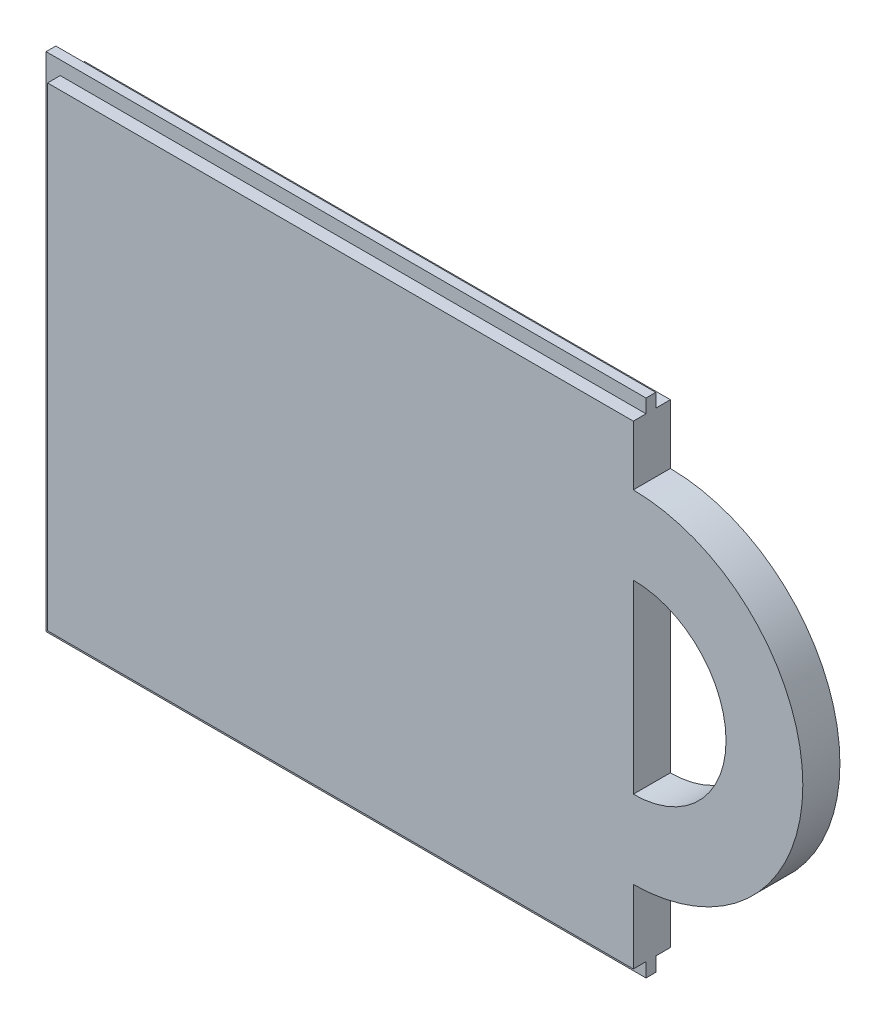
ISO-10303-21;
HEADER;
FILE_DESCRIPTION(('STEP AP214'),'2;1');
FILE_NAME('part.step','',(''),(''),'','','');
FILE_SCHEMA(('AUTOMOTIVE_DESIGN { 1 0 10303 214 1 1 1 1 }'));
ENDSEC;
DATA;
#1=APPLICATION_CONTEXT('core data for automotive mechanical design processes');
#2=APPLICATION_PROTOCOL_DEFINITION('international standard','automotive_design',2000,#1);
#3=PRODUCT_CONTEXT('',#1,'mechanical');
#4=PRODUCT('Part','Part','',(#3));
#5=PRODUCT_RELATED_PRODUCT_CATEGORY('part','',(#4));
#6=PRODUCT_DEFINITION_FORMATION('','',#4);
#7=PRODUCT_DEFINITION_CONTEXT('part definition',#1,'design');
#8=PRODUCT_DEFINITION('design','',#6,#7);
#9=PRODUCT_DEFINITION_SHAPE('','',#8);
#10=(LENGTH_UNIT() NAMED_UNIT(*) SI_UNIT(.MILLI.,.METRE.));
#11=(NAMED_UNIT(*) PLANE_ANGLE_UNIT() SI_UNIT($,.RADIAN.));
#12=(NAMED_UNIT(*) SI_UNIT($,.STERADIAN.) SOLID_ANGLE_UNIT());
#13=UNCERTAINTY_MEASURE_WITH_UNIT(LENGTH_MEASURE(1.E-05),#10,'distance_accuracy_value','');
#14=(GEOMETRIC_REPRESENTATION_CONTEXT(3) GLOBAL_UNCERTAINTY_ASSIGNED_CONTEXT((#13)) GLOBAL_UNIT_ASSIGNED_CONTEXT((#10,
#11,#12)) REPRESENTATION_CONTEXT('',''));
#15=CARTESIAN_POINT('',(0.,0.,0.));
#16=DIRECTION('',(0.,0.,1.));
#17=DIRECTION('',(1.,0.,0.));
#18=AXIS2_PLACEMENT_3D('',#15,#16,#17);
#19=CARTESIAN_POINT('',(-30.8641975308642,23.6,3.8));
#20=DIRECTION('',(1.,0.,0.));
#21=DIRECTION('',(0.,1.,0.));
#22=AXIS2_PLACEMENT_3D('',#19,#20,#21);
#23=PLANE('',#22);
#24=DIRECTION('',(0.,1.,0.));
#25=VECTOR('',#24,1.);
#26=CARTESIAN_POINT('',(-30.8641975308642,23.6,2.5));
#27=LINE('',#26,#25);
#28=CARTESIAN_POINT('',(-30.8641975308642,-25.,2.5));
#29=VERTEX_POINT('',#28);
#30=CARTESIAN_POINT('',(-30.8641975308642,23.6,2.5));
#31=VERTEX_POINT('',#30);
#32=EDGE_CURVE('E56',#29,#31,#27,.T.);
#33=ORIENTED_EDGE('',*,*,#32,.F.);
#34=DIRECTION('',(0.,0.,-1.));
#35=VECTOR('',#34,1.);
#36=CARTESIAN_POINT('',(-30.8641975308642,-25.,3.8));
#37=LINE('',#36,#35);
#38=CARTESIAN_POINT('',(-30.8641975308642,-25.,3.8));
#39=VERTEX_POINT('',#38);
#40=EDGE_CURVE('E11',#39,#29,#37,.T.);
#41=ORIENTED_EDGE('',*,*,#40,.F.);
#42=DIRECTION('',(0.,-1.,0.));
#43=VECTOR('',#42,1.);
#44=CARTESIAN_POINT('',(-30.8641975308642,23.6,3.8));
#45=LINE('',#44,#43);
#46=CARTESIAN_POINT('',(-30.8641975308642,23.6,3.8));
#47=VERTEX_POINT('',#46);
#48=EDGE_CURVE('E231',#47,#39,#45,.T.);
#49=ORIENTED_EDGE('',*,*,#48,.F.);
#50=DIRECTION('',(0.,0.,-1.));
#51=VECTOR('',#50,1.);
#52=CARTESIAN_POINT('',(-30.8641975308642,23.6,3.8));
#53=LINE('',#52,#51);
#54=EDGE_CURVE('E255',#47,#31,#53,.T.);
#55=ORIENTED_EDGE('',*,*,#54,.T.);
#56=EDGE_LOOP('',(#33,#41,#49,#55));
#57=FACE_BOUND('',#56,.T.);
#58=ADVANCED_FACE('F33',(#57),#23,.F.);
#59=CARTESIAN_POINT('',(29.1358024691358,-25.,3.8));
#60=DIRECTION('',(0.,1.,0.));
#61=DIRECTION('',(-1.,0.,0.));
#62=AXIS2_PLACEMENT_3D('',#59,#60,#61);
#63=PLANE('',#62);
#64=DIRECTION('',(-1.,0.,0.));
#65=VECTOR('',#64,1.);
#66=CARTESIAN_POINT('',(29.1358024691358,-25.,2.5));
#67=LINE('',#66,#65);
#68=CARTESIAN_POINT('',(29.1358024691358,-25.,2.5));
#69=VERTEX_POINT('',#68);
#70=EDGE_CURVE('E196',#69,#29,#67,.T.);
#71=ORIENTED_EDGE('',*,*,#70,.F.);
#72=DIRECTION('',(0.,0.,-1.));
#73=VECTOR('',#72,1.);
#74=CARTESIAN_POINT('',(29.1358024691358,-25.,3.8));
#75=LINE('',#74,#73);
#76=CARTESIAN_POINT('',(29.1358024691358,-25.,3.8));
#77=VERTEX_POINT('',#76);
#78=EDGE_CURVE('E260',#77,#69,#75,.T.);
#79=ORIENTED_EDGE('',*,*,#78,.F.);
#80=DIRECTION('',(1.,0.,0.));
#81=VECTOR('',#80,1.);
#82=CARTESIAN_POINT('',(29.1358024691358,-25.,3.8));
#83=LINE('',#82,#81);
#84=EDGE_CURVE('E234',#39,#77,#83,.T.);
#85=ORIENTED_EDGE('',*,*,#84,.F.);
#86=ORIENTED_EDGE('',*,*,#40,.T.);
#87=EDGE_LOOP('',(#71,#79,#85,#86));
#88=FACE_BOUND('',#87,.T.);
#89=ADVANCED_FACE('F285',(#88),#63,.F.);
#90=CARTESIAN_POINT('',(29.1358024691358,23.6,3.8));
#91=DIRECTION('',(0.,-1.,0.));
#92=DIRECTION('',(1.,0.,0.));
#93=AXIS2_PLACEMENT_3D('',#90,#91,#92);
#94=PLANE('',#93);
#95=DIRECTION('',(1.,0.,0.));
#96=VECTOR('',#95,1.);
#97=CARTESIAN_POINT('',(29.1358024691358,23.6,2.5));
#98=LINE('',#97,#96);
#99=CARTESIAN_POINT('',(29.1358024691358,23.6,2.5));
#100=VERTEX_POINT('',#99);
#101=EDGE_CURVE('E188',#31,#100,#98,.T.);
#102=ORIENTED_EDGE('',*,*,#101,.F.);
#103=ORIENTED_EDGE('',*,*,#54,.F.);
#104=DIRECTION('',(-1.,0.,0.));
#105=VECTOR('',#104,1.);
#106=CARTESIAN_POINT('',(29.1358024691358,23.6,3.8));
#107=LINE('',#106,#105);
#108=CARTESIAN_POINT('',(29.1358024691358,23.6,3.8));
#109=VERTEX_POINT('',#108);
#110=EDGE_CURVE('E241',#109,#47,#107,.T.);
#111=ORIENTED_EDGE('',*,*,#110,.F.);
#112=DIRECTION('',(0.,0.,-1.));
#113=VECTOR('',#112,1.);
#114=CARTESIAN_POINT('',(29.1358024691358,23.6,3.8));
#115=LINE('',#114,#113);
#116=EDGE_CURVE('E258',#109,#100,#115,.T.);
#117=ORIENTED_EDGE('',*,*,#116,.T.);
#118=EDGE_LOOP('',(#102,#103,#111,#117));
#119=FACE_BOUND('',#118,.T.);
#120=ADVANCED_FACE('F308',(#119),#94,.F.);
#121=CARTESIAN_POINT('',(29.1358024691358,23.6,3.8));
#122=DIRECTION('',(-1.,0.,0.));
#123=DIRECTION('',(0.,-1.,0.));
#124=AXIS2_PLACEMENT_3D('',#121,#122,#123);
#125=PLANE('',#124);
#126=DIRECTION('',(0.,0.,1.));
#127=VECTOR('',#126,1.);
#128=CARTESIAN_POINT('',(29.1358024691358,-17.4994861634678,-49.4974746830584));
#129=LINE('',#128,#127);
#130=CARTESIAN_POINT('',(29.1358024691358,-17.4994861634678,0.));
#131=VERTEX_POINT('',#130);
#132=CARTESIAN_POINT('',(29.1358024691358,-17.4994861634678,3.8));
#133=VERTEX_POINT('',#132);
#134=EDGE_CURVE('E228',#131,#133,#129,.T.);
#135=ORIENTED_EDGE('',*,*,#134,.T.);
#136=DIRECTION('',(0.,1.,0.));
#137=VECTOR('',#136,1.);
#138=CARTESIAN_POINT('',(29.1358024691358,23.6,3.8));
#139=LINE('',#138,#137);
#140=EDGE_CURVE('E238',#77,#133,#139,.T.);
#141=ORIENTED_EDGE('',*,*,#140,.F.);
#142=ORIENTED_EDGE('',*,*,#78,.T.);
#143=DIRECTION('',(0.,1.,0.));
#144=VECTOR('',#143,1.);
#145=CARTESIAN_POINT('',(29.1358024691358,25.,2.5));
#146=LINE('',#145,#144);
#147=CARTESIAN_POINT('',(29.1358024691358,-26.45,2.5));
#148=VERTEX_POINT('',#147);
#149=EDGE_CURVE('E176',#148,#69,#146,.T.);
#150=ORIENTED_EDGE('',*,*,#149,.F.);
#151=DIRECTION('',(0.,0.,1.));
#152=VECTOR('',#151,1.);
#153=CARTESIAN_POINT('',(29.1358024691358,-26.45,1.5));
#154=LINE('',#153,#152);
#155=CARTESIAN_POINT('',(29.1358024691358,-26.45,1.5));
#156=VERTEX_POINT('',#155);
#157=EDGE_CURVE('E157',#156,#148,#154,.T.);
#158=ORIENTED_EDGE('',*,*,#157,.F.);
#159=DIRECTION('',(0.,1.,0.));
#160=VECTOR('',#159,1.);
#161=CARTESIAN_POINT('',(29.1358024691358,25.,1.5));
#162=LINE('',#161,#160);
#163=CARTESIAN_POINT('',(29.1358024691358,-25.,1.5));
#164=VERTEX_POINT('',#163);
#165=EDGE_CURVE('E168',#156,#164,#162,.T.);
#166=ORIENTED_EDGE('',*,*,#165,.T.);
#167=CARTESIAN_POINT('',(29.1358024691358,-25.,0.));
#168=VERTEX_POINT('',#167);
#169=EDGE_CURVE('E259',#164,#168,#75,.T.);
#170=ORIENTED_EDGE('',*,*,#169,.T.);
#171=DIRECTION('',(0.,1.,0.));
#172=VECTOR('',#171,1.);
#173=CARTESIAN_POINT('',(29.1358024691358,23.6,0.));
#174=LINE('',#173,#172);
#175=EDGE_CURVE('E250',#168,#131,#174,.T.);
#176=ORIENTED_EDGE('',*,*,#175,.T.);
#177=EDGE_LOOP('',(#135,#141,#142,#150,#158,#166,#170,#176));
#178=FACE_BOUND('',#177,.T.);
#179=ADVANCED_FACE('F266',(#178),#125,.F.);
#180=CARTESIAN_POINT('',(-30.8641975308642,-25.,1.5));
#181=VERTEX_POINT('',#180);
#182=CARTESIAN_POINT('',(-30.8641975308642,-25.,0.));
#183=VERTEX_POINT('',#182);
#184=EDGE_CURVE('E41',#181,#183,#37,.T.);
#185=ORIENTED_EDGE('',*,*,#184,.F.);
#186=DIRECTION('',(0.,1.,0.));
#187=VECTOR('',#186,1.);
#188=CARTESIAN_POINT('',(-30.8641975308642,23.6,1.5));
#189=LINE('',#188,#187);
#190=CARTESIAN_POINT('',(-30.8641975308642,23.6,1.5));
#191=VERTEX_POINT('',#190);
#192=EDGE_CURVE('E201',#181,#191,#189,.T.);
#193=ORIENTED_EDGE('',*,*,#192,.T.);
#194=CARTESIAN_POINT('',(-30.8641975308642,23.6,0.));
#195=VERTEX_POINT('',#194);
#196=EDGE_CURVE('E243',#191,#195,#53,.T.);
#197=ORIENTED_EDGE('',*,*,#196,.T.);
#198=DIRECTION('',(0.,-1.,0.));
#199=VECTOR('',#198,1.);
#200=CARTESIAN_POINT('',(-30.8641975308642,23.6,0.));
#201=LINE('',#200,#199);
#202=EDGE_CURVE('E230',#195,#183,#201,.T.);
#203=ORIENTED_EDGE('',*,*,#202,.T.);
#204=EDGE_LOOP('',(#185,#193,#197,#203));
#205=FACE_BOUND('',#204,.T.);
#206=ADVANCED_FACE('F35',(#205),#23,.F.);
#207=ORIENTED_EDGE('',*,*,#169,.F.);
#208=DIRECTION('',(-1.,0.,0.));
#209=VECTOR('',#208,1.);
#210=CARTESIAN_POINT('',(29.1358024691358,-25.,1.5));
#211=LINE('',#210,#209);
#212=EDGE_CURVE('E48',#164,#181,#211,.T.);
#213=ORIENTED_EDGE('',*,*,#212,.T.);
#214=ORIENTED_EDGE('',*,*,#184,.T.);
#215=DIRECTION('',(1.,0.,0.));
#216=VECTOR('',#215,1.);
#217=CARTESIAN_POINT('',(29.1358024691358,-25.,0.));
#218=LINE('',#217,#216);
#219=EDGE_CURVE('E246',#183,#168,#218,.T.);
#220=ORIENTED_EDGE('',*,*,#219,.T.);
#221=EDGE_LOOP('',(#207,#213,#214,#220));
#222=FACE_BOUND('',#221,.T.);
#223=ADVANCED_FACE('F269',(#222),#63,.F.);
#224=CARTESIAN_POINT('',(29.1358024691358,23.6,1.5));
#225=VERTEX_POINT('',#224);
#226=CARTESIAN_POINT('',(29.1358024691358,23.6,0.));
#227=VERTEX_POINT('',#226);
#228=EDGE_CURVE('E257',#225,#227,#115,.T.);
#229=ORIENTED_EDGE('',*,*,#228,.F.);
#230=CARTESIAN_POINT('',(29.1358024691358,25.,1.5));
#231=VERTEX_POINT('',#230);
#232=EDGE_CURVE('E169',#225,#231,#162,.T.);
#233=ORIENTED_EDGE('',*,*,#232,.T.);
#234=DIRECTION('',(0.,0.,1.));
#235=VECTOR('',#234,1.);
#236=CARTESIAN_POINT('',(29.1358024691358,25.,1.5));
#237=LINE('',#236,#235);
#238=CARTESIAN_POINT('',(29.1358024691358,25.,2.5));
#239=VERTEX_POINT('',#238);
#240=EDGE_CURVE('E189',#231,#239,#237,.T.);
#241=ORIENTED_EDGE('',*,*,#240,.T.);
#242=EDGE_CURVE('E184',#100,#239,#146,.T.);
#243=ORIENTED_EDGE('',*,*,#242,.F.);
#244=ORIENTED_EDGE('',*,*,#116,.F.);
#245=CARTESIAN_POINT('',(29.1358024691358,17.4994861634678,3.8));
#246=VERTEX_POINT('',#245);
#247=EDGE_CURVE('E237',#246,#109,#139,.T.);
#248=ORIENTED_EDGE('',*,*,#247,.F.);
#249=DIRECTION('',(0.,0.,1.));
#250=VECTOR('',#249,1.);
#251=CARTESIAN_POINT('',(29.1358024691358,17.4994861634678,-49.4974746830584));
#252=LINE('',#251,#250);
#253=CARTESIAN_POINT('',(29.1358024691358,17.4994861634678,0.));
#254=VERTEX_POINT('',#253);
#255=EDGE_CURVE('E226',#246,#254,#252,.F.);
#256=ORIENTED_EDGE('',*,*,#255,.T.);
#257=EDGE_CURVE('E249',#254,#227,#174,.T.);
#258=ORIENTED_EDGE('',*,*,#257,.T.);
#259=EDGE_LOOP('',(#229,#233,#241,#243,#244,#248,#256,#258));
#260=FACE_BOUND('',#259,.T.);
#261=ADVANCED_FACE('F298',(#260),#125,.F.);
#262=ORIENTED_EDGE('',*,*,#196,.F.);
#263=DIRECTION('',(1.,0.,0.));
#264=VECTOR('',#263,1.);
#265=CARTESIAN_POINT('',(29.1358024691358,23.6,1.5));
#266=LINE('',#265,#264);
#267=EDGE_CURVE('E199',#191,#225,#266,.T.);
#268=ORIENTED_EDGE('',*,*,#267,.T.);
#269=ORIENTED_EDGE('',*,*,#228,.T.);
#270=DIRECTION('',(-1.,0.,0.));
#271=VECTOR('',#270,1.);
#272=CARTESIAN_POINT('',(29.1358024691358,23.6,0.));
#273=LINE('',#272,#271);
#274=EDGE_CURVE('E235',#227,#195,#273,.T.);
#275=ORIENTED_EDGE('',*,*,#274,.T.);
#276=EDGE_LOOP('',(#262,#268,#269,#275));
#277=FACE_BOUND('',#276,.T.);
#278=ADVANCED_FACE('F301',(#277),#94,.F.);
#279=CARTESIAN_POINT('',(0.,0.,3.8));
#280=DIRECTION('',(0.,0.,-1.));
#281=DIRECTION('',(-1.,0.,0.));
#282=AXIS2_PLACEMENT_3D('',#279,#280,#281);
#283=PLANE('',#282);
#284=DIRECTION('',(0.,-1.,0.));
#285=VECTOR('',#284,1.);
#286=CARTESIAN_POINT('',(29.1358024691358,9.49948616346775,3.8));
#287=LINE('',#286,#285);
#288=CARTESIAN_POINT('',(29.1358024691358,9.49948616346775,3.8));
#289=VERTEX_POINT('',#288);
#290=CARTESIAN_POINT('',(29.1358024691358,-9.49948616346775,3.8));
#291=VERTEX_POINT('',#290);
#292=EDGE_CURVE('E210',#289,#291,#287,.T.);
#293=ORIENTED_EDGE('',*,*,#292,.F.);
#294=CARTESIAN_POINT('',(29.1358024691358,0.,3.8));
#295=DIRECTION('',(0.,0.,1.));
#296=DIRECTION('',(-1.,0.,0.));
#297=AXIS2_PLACEMENT_3D('',#294,#295,#296);
#298=CIRCLE('',#297,9.49948616346775);
#299=EDGE_CURVE('E207',#291,#289,#298,.T.);
#300=ORIENTED_EDGE('',*,*,#299,.F.);
#301=EDGE_LOOP('',(#293,#300));
#302=FACE_BOUND('',#301,.T.);
#303=ORIENTED_EDGE('',*,*,#140,.T.);
#304=CARTESIAN_POINT('',(29.0016979777832,0.,3.8));
#305=DIRECTION('',(0.,0.,1.));
#306=DIRECTION('',(1.,0.,0.));
#307=AXIS2_PLACEMENT_3D('',#304,#305,#306);
#308=CIRCLE('',#307,17.5);
#309=EDGE_CURVE('E220',#133,#246,#308,.T.);
#310=ORIENTED_EDGE('',*,*,#309,.T.);
#311=ORIENTED_EDGE('',*,*,#247,.T.);
#312=ORIENTED_EDGE('',*,*,#110,.T.);
#313=ORIENTED_EDGE('',*,*,#48,.T.);
#314=ORIENTED_EDGE('',*,*,#84,.T.);
#315=EDGE_LOOP('',(#303,#310,#311,#312,#313,#314));
#316=FACE_BOUND('',#315,.T.);
#317=ADVANCED_FACE('F281',(#302,#316),#283,.F.);
#318=CARTESIAN_POINT('',(0.,0.,0.));
#319=DIRECTION('',(0.,0.,-1.));
#320=DIRECTION('',(-1.,0.,0.));
#321=AXIS2_PLACEMENT_3D('',#318,#319,#320);
#322=PLANE('',#321);
#323=CARTESIAN_POINT('',(29.1358024691358,0.,0.));
#324=DIRECTION('',(0.,0.,-1.));
#325=DIRECTION('',(-1.,0.,0.));
#326=AXIS2_PLACEMENT_3D('',#323,#324,#325);
#327=CIRCLE('',#326,9.49948616346775);
#328=CARTESIAN_POINT('',(29.1358024691358,-9.49948616346775,0.));
#329=VERTEX_POINT('',#328);
#330=CARTESIAN_POINT('',(29.1358024691358,9.49948616346775,0.));
#331=VERTEX_POINT('',#330);
#332=EDGE_CURVE('E204',#329,#331,#327,.F.);
#333=ORIENTED_EDGE('',*,*,#332,.T.);
#334=DIRECTION('',(0.,-1.,0.));
#335=VECTOR('',#334,1.);
#336=CARTESIAN_POINT('',(29.1358024691358,9.49948616346775,0.));
#337=LINE('',#336,#335);
#338=EDGE_CURVE('E216',#331,#329,#337,.T.);
#339=ORIENTED_EDGE('',*,*,#338,.T.);
#340=EDGE_LOOP('',(#333,#339));
#341=FACE_BOUND('',#340,.T.);
#342=ORIENTED_EDGE('',*,*,#257,.F.);
#343=CARTESIAN_POINT('',(29.0016979777832,0.,0.));
#344=DIRECTION('',(0.,0.,-1.));
#345=DIRECTION('',(-1.,0.,0.));
#346=AXIS2_PLACEMENT_3D('',#343,#344,#345);
#347=CIRCLE('',#346,17.5);
#348=EDGE_CURVE('E223',#131,#254,#347,.F.);
#349=ORIENTED_EDGE('',*,*,#348,.F.);
#350=ORIENTED_EDGE('',*,*,#175,.F.);
#351=ORIENTED_EDGE('',*,*,#219,.F.);
#352=ORIENTED_EDGE('',*,*,#202,.F.);
#353=ORIENTED_EDGE('',*,*,#274,.F.);
#354=EDGE_LOOP('',(#342,#349,#350,#351,#352,#353));
#355=FACE_BOUND('',#354,.T.);
#356=ADVANCED_FACE('F274',(#341,#355),#322,.T.);
#357=CARTESIAN_POINT('',(29.0016979777832,0.,-49.4974746830584));
#358=DIRECTION('',(0.,0.,1.));
#359=DIRECTION('',(1.,0.,0.));
#360=AXIS2_PLACEMENT_3D('',#357,#358,#359);
#361=CYLINDRICAL_SURFACE('',#360,17.5);
#362=ORIENTED_EDGE('',*,*,#134,.F.);
#363=ORIENTED_EDGE('',*,*,#348,.T.);
#364=ORIENTED_EDGE('',*,*,#255,.F.);
#365=ORIENTED_EDGE('',*,*,#309,.F.);
#366=EDGE_LOOP('',(#362,#363,#364,#365));
#367=FACE_BOUND('',#366,.T.);
#368=ADVANCED_FACE('F278',(#367),#361,.T.);
#369=CARTESIAN_POINT('',(29.1358024691358,0.,-0.00100000000000013));
#370=DIRECTION('',(0.,0.,1.));
#371=DIRECTION('',(1.,0.,0.));
#372=AXIS2_PLACEMENT_3D('',#369,#370,#371);
#373=CYLINDRICAL_SURFACE('',#372,9.49948616346775);
#374=DIRECTION('',(0.,0.,1.));
#375=VECTOR('',#374,1.);
#376=CARTESIAN_POINT('',(29.1358024691358,-9.49948616346775,-0.00100000000000013));
#377=LINE('',#376,#375);
#378=EDGE_CURVE('E214',#329,#291,#377,.T.);
#379=ORIENTED_EDGE('',*,*,#378,.T.);
#380=ORIENTED_EDGE('',*,*,#299,.T.);
#381=DIRECTION('',(0.,0.,1.));
#382=VECTOR('',#381,1.);
#383=CARTESIAN_POINT('',(29.1358024691358,9.49948616346775,-0.00100000000000013));
#384=LINE('',#383,#382);
#385=EDGE_CURVE('E213',#331,#289,#384,.T.);
#386=ORIENTED_EDGE('',*,*,#385,.F.);
#387=ORIENTED_EDGE('',*,*,#332,.F.);
#388=EDGE_LOOP('',(#379,#380,#386,#387));
#389=FACE_BOUND('',#388,.T.);
#390=ADVANCED_FACE('F330',(#389),#373,.F.);
#391=CARTESIAN_POINT('',(29.1358024691358,9.49948616346775,-0.00100000000000013));
#392=DIRECTION('',(-1.,0.,0.));
#393=DIRECTION('',(0.,0.,1.));
#394=AXIS2_PLACEMENT_3D('',#391,#392,#393);
#395=PLANE('',#394);
#396=ORIENTED_EDGE('',*,*,#385,.T.);
#397=ORIENTED_EDGE('',*,*,#292,.T.);
#398=ORIENTED_EDGE('',*,*,#378,.F.);
#399=ORIENTED_EDGE('',*,*,#338,.F.);
#400=EDGE_LOOP('',(#396,#397,#398,#399));
#401=FACE_BOUND('',#400,.T.);
#402=ADVANCED_FACE('F333',(#401),#395,.F.);
#403=CARTESIAN_POINT('',(0.,0.,1.5));
#404=DIRECTION('',(0.,0.,-1.));
#405=DIRECTION('',(-1.,0.,0.));
#406=AXIS2_PLACEMENT_3D('',#403,#404,#405);
#407=PLANE('',#406);
#408=ORIENTED_EDGE('',*,*,#212,.F.);
#409=ORIENTED_EDGE('',*,*,#165,.F.);
#410=DIRECTION('',(1.,0.,0.));
#411=VECTOR('',#410,1.);
#412=CARTESIAN_POINT('',(29.1358024691358,-26.45,1.5));
#413=LINE('',#412,#411);
#414=CARTESIAN_POINT('',(-32.3141975308642,-26.45,1.5));
#415=VERTEX_POINT('',#414);
#416=EDGE_CURVE('E150',#415,#156,#413,.T.);
#417=ORIENTED_EDGE('',*,*,#416,.F.);
#418=DIRECTION('',(0.,-1.,0.));
#419=VECTOR('',#418,1.);
#420=CARTESIAN_POINT('',(-32.3141975308642,25.,1.5));
#421=LINE('',#420,#419);
#422=CARTESIAN_POINT('',(-32.3141975308642,25.,1.5));
#423=VERTEX_POINT('',#422);
#424=EDGE_CURVE('E165',#423,#415,#421,.T.);
#425=ORIENTED_EDGE('',*,*,#424,.F.);
#426=DIRECTION('',(-1.,0.,0.));
#427=VECTOR('',#426,1.);
#428=CARTESIAN_POINT('',(29.1358024691358,25.,1.5));
#429=LINE('',#428,#427);
#430=EDGE_CURVE('E158',#231,#423,#429,.T.);
#431=ORIENTED_EDGE('',*,*,#430,.F.);
#432=ORIENTED_EDGE('',*,*,#232,.F.);
#433=ORIENTED_EDGE('',*,*,#267,.F.);
#434=ORIENTED_EDGE('',*,*,#192,.F.);
#435=EDGE_LOOP('',(#408,#409,#417,#425,#431,#432,#433,#434));
#436=FACE_BOUND('',#435,.T.);
#437=ADVANCED_FACE('F163',(#436),#407,.T.);
#438=CARTESIAN_POINT('',(0.,0.,2.5));
#439=DIRECTION('',(0.,0.,-1.));
#440=DIRECTION('',(-1.,0.,0.));
#441=AXIS2_PLACEMENT_3D('',#438,#439,#440);
#442=PLANE('',#441);
#443=ORIENTED_EDGE('',*,*,#149,.T.);
#444=ORIENTED_EDGE('',*,*,#70,.T.);
#445=ORIENTED_EDGE('',*,*,#32,.T.);
#446=ORIENTED_EDGE('',*,*,#101,.T.);
#447=ORIENTED_EDGE('',*,*,#242,.T.);
#448=DIRECTION('',(-1.,0.,0.));
#449=VECTOR('',#448,1.);
#450=CARTESIAN_POINT('',(29.1358024691358,25.,2.5));
#451=LINE('',#450,#449);
#452=CARTESIAN_POINT('',(-32.3141975308642,25.,2.5));
#453=VERTEX_POINT('',#452);
#454=EDGE_CURVE('E173',#239,#453,#451,.T.);
#455=ORIENTED_EDGE('',*,*,#454,.T.);
#456=DIRECTION('',(0.,-1.,0.));
#457=VECTOR('',#456,1.);
#458=CARTESIAN_POINT('',(-32.3141975308642,25.,2.5));
#459=LINE('',#458,#457);
#460=CARTESIAN_POINT('',(-32.3141975308642,-26.45,2.5));
#461=VERTEX_POINT('',#460);
#462=EDGE_CURVE('E181',#453,#461,#459,.T.);
#463=ORIENTED_EDGE('',*,*,#462,.T.);
#464=DIRECTION('',(1.,0.,0.));
#465=VECTOR('',#464,1.);
#466=CARTESIAN_POINT('',(29.1358024691358,-26.45,2.5));
#467=LINE('',#466,#465);
#468=EDGE_CURVE('E152',#461,#148,#467,.T.);
#469=ORIENTED_EDGE('',*,*,#468,.T.);
#470=EDGE_LOOP('',(#443,#444,#445,#446,#447,#455,#463,#469));
#471=FACE_BOUND('',#470,.T.);
#472=ADVANCED_FACE('F287',(#471),#442,.F.);
#473=CARTESIAN_POINT('',(-32.3141975308642,25.,1.5));
#474=DIRECTION('',(-1.,0.,0.));
#475=DIRECTION('',(0.,-1.,0.));
#476=AXIS2_PLACEMENT_3D('',#473,#474,#475);
#477=PLANE('',#476);
#478=ORIENTED_EDGE('',*,*,#462,.F.);
#479=DIRECTION('',(0.,0.,1.));
#480=VECTOR('',#479,1.);
#481=CARTESIAN_POINT('',(-32.3141975308642,25.,1.5));
#482=LINE('',#481,#480);
#483=EDGE_CURVE('E172',#423,#453,#482,.T.);
#484=ORIENTED_EDGE('',*,*,#483,.F.);
#485=ORIENTED_EDGE('',*,*,#424,.T.);
#486=DIRECTION('',(0.,0.,1.));
#487=VECTOR('',#486,1.);
#488=CARTESIAN_POINT('',(-32.3141975308642,-26.45,1.5));
#489=LINE('',#488,#487);
#490=EDGE_CURVE('E147',#415,#461,#489,.T.);
#491=ORIENTED_EDGE('',*,*,#490,.T.);
#492=EDGE_LOOP('',(#478,#484,#485,#491));
#493=FACE_BOUND('',#492,.T.);
#494=ADVANCED_FACE('F171',(#493),#477,.T.);
#495=CARTESIAN_POINT('',(29.1358024691358,25.,1.5));
#496=DIRECTION('',(0.,1.,0.));
#497=DIRECTION('',(-1.,0.,0.));
#498=AXIS2_PLACEMENT_3D('',#495,#496,#497);
#499=PLANE('',#498);
#500=ORIENTED_EDGE('',*,*,#454,.F.);
#501=ORIENTED_EDGE('',*,*,#240,.F.);
#502=ORIENTED_EDGE('',*,*,#430,.T.);
#503=ORIENTED_EDGE('',*,*,#483,.T.);
#504=EDGE_LOOP('',(#500,#501,#502,#503));
#505=FACE_BOUND('',#504,.T.);
#506=ADVANCED_FACE('F292',(#505),#499,.T.);
#507=CARTESIAN_POINT('',(29.1358024691358,-26.45,1.5));
#508=DIRECTION('',(0.,-1.,0.));
#509=DIRECTION('',(1.,0.,0.));
#510=AXIS2_PLACEMENT_3D('',#507,#508,#509);
#511=PLANE('',#510);
#512=ORIENTED_EDGE('',*,*,#468,.F.);
#513=ORIENTED_EDGE('',*,*,#490,.F.);
#514=ORIENTED_EDGE('',*,*,#416,.T.);
#515=ORIENTED_EDGE('',*,*,#157,.T.);
#516=EDGE_LOOP('',(#512,#513,#514,#515));
#517=FACE_BOUND('',#516,.T.);
#518=ADVANCED_FACE('F149',(#517),#511,.T.);
#519=CLOSED_SHELL('',(#58,#89,#120,#179,#206,#223,#261,#278,#317,#356,#368,#390,#402,#437,#472,
#494,#506,#518));
#520=MANIFOLD_SOLID_BREP('B2',#519);
#521=ADVANCED_BREP_SHAPE_REPRESENTATION('',(#18,#520),#14);
#522=SHAPE_DEFINITION_REPRESENTATION(#9,#521);
ENDSEC;
END-ISO-10303-21;
